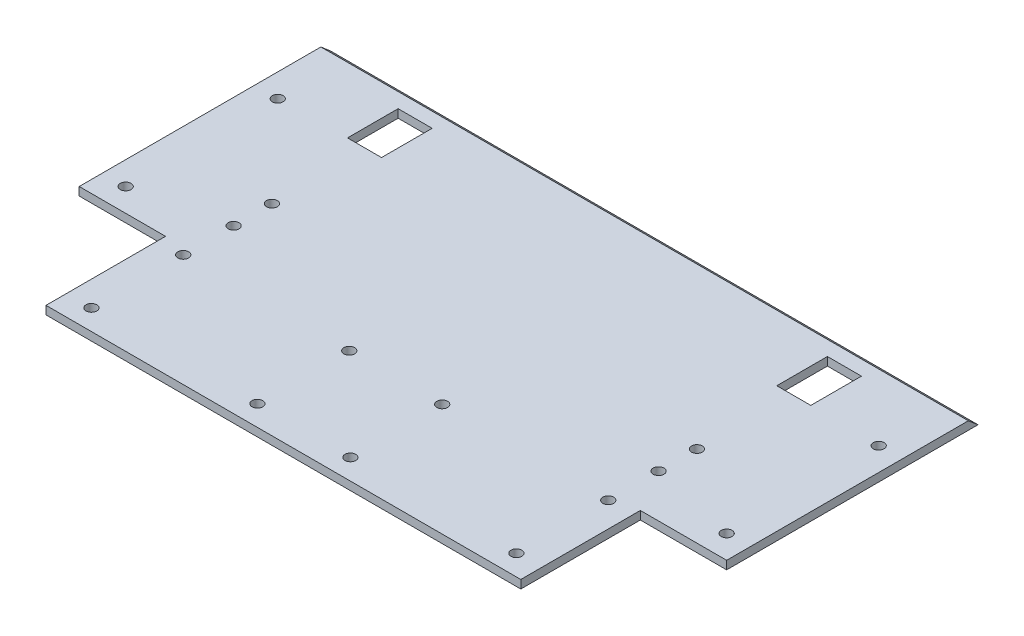
ISO-10303-21;
HEADER;
FILE_DESCRIPTION(('STEP AP214'),'2;1');
FILE_NAME('part.step','',(''),(''),'','','');
FILE_SCHEMA(('AUTOMOTIVE_DESIGN { 1 0 10303 214 1 1 1 1 }'));
ENDSEC;
DATA;
#1=APPLICATION_CONTEXT('core data for automotive mechanical design processes');
#2=APPLICATION_PROTOCOL_DEFINITION('international standard','automotive_design',2000,#1);
#3=PRODUCT_CONTEXT('',#1,'mechanical');
#4=PRODUCT('Part','Part','',(#3));
#5=PRODUCT_RELATED_PRODUCT_CATEGORY('part','',(#4));
#6=PRODUCT_DEFINITION_FORMATION('','',#4);
#7=PRODUCT_DEFINITION_CONTEXT('part definition',#1,'design');
#8=PRODUCT_DEFINITION('design','',#6,#7);
#9=PRODUCT_DEFINITION_SHAPE('','',#8);
#10=(LENGTH_UNIT() NAMED_UNIT(*) SI_UNIT(.MILLI.,.METRE.));
#11=(NAMED_UNIT(*) PLANE_ANGLE_UNIT() SI_UNIT($,.RADIAN.));
#12=(NAMED_UNIT(*) SI_UNIT($,.STERADIAN.) SOLID_ANGLE_UNIT());
#13=UNCERTAINTY_MEASURE_WITH_UNIT(LENGTH_MEASURE(1.E-05),#10,'distance_accuracy_value','');
#14=(GEOMETRIC_REPRESENTATION_CONTEXT(3) GLOBAL_UNCERTAINTY_ASSIGNED_CONTEXT((#13)) GLOBAL_UNIT_ASSIGNED_CONTEXT((#10,
#11,#12)) REPRESENTATION_CONTEXT('',''));
#15=CARTESIAN_POINT('',(0.,0.,0.));
#16=DIRECTION('',(0.,0.,1.));
#17=DIRECTION('',(1.,0.,0.));
#18=AXIS2_PLACEMENT_3D('',#15,#16,#17);
#19=CARTESIAN_POINT('',(-97.5,2.5,0.));
#20=DIRECTION('',(-1.,0.,0.));
#21=DIRECTION('',(0.,0.,1.));
#22=AXIS2_PLACEMENT_3D('',#19,#20,#21);
#23=PLANE('',#22);
#24=DIRECTION('',(0.,0.,-1.));
#25=VECTOR('',#24,1.);
#26=CARTESIAN_POINT('',(-97.5,0.,0.));
#27=LINE('',#26,#25);
#28=CARTESIAN_POINT('',(-97.5,0.,25.0000000000045));
#29=VERTEX_POINT('',#28);
#30=CARTESIAN_POINT('',(-97.5,0.,-50.6999999999954));
#31=VERTEX_POINT('',#30);
#32=EDGE_CURVE('E272',#29,#31,#27,.T.);
#33=ORIENTED_EDGE('',*,*,#32,.F.);
#34=DIRECTION('',(0.,-1.,0.));
#35=VECTOR('',#34,1.);
#36=CARTESIAN_POINT('',(-97.5,2.5,25.0000000000045));
#37=LINE('',#36,#35);
#38=CARTESIAN_POINT('',(-97.5,2.5,25.0000000000045));
#39=VERTEX_POINT('',#38);
#40=EDGE_CURVE('E11',#39,#29,#37,.T.);
#41=ORIENTED_EDGE('',*,*,#40,.F.);
#42=DIRECTION('',(0.,0.,-1.));
#43=VECTOR('',#42,1.);
#44=CARTESIAN_POINT('',(-97.5,2.5,0.));
#45=LINE('',#44,#43);
#46=CARTESIAN_POINT('',(-97.5,2.50000000000003,-47.7831999517202));
#47=VERTEX_POINT('',#46);
#48=EDGE_CURVE('E275',#39,#47,#45,.T.);
#49=ORIENTED_EDGE('',*,*,#48,.T.);
#50=DIRECTION('',(0.,0.650774217265846,0.759271307334885));
#51=VECTOR('',#50,1.);
#52=CARTESIAN_POINT('',(-97.5,2.50000000000001,-47.7831999517203));
#53=LINE('',#52,#51);
#54=EDGE_CURVE('E266',#31,#47,#53,.T.);
#55=ORIENTED_EDGE('',*,*,#54,.F.);
#56=EDGE_LOOP('',(#33,#41,#49,#55));
#57=FACE_BOUND('',#56,.T.);
#58=ADVANCED_FACE('F40',(#57),#23,.T.);
#59=CARTESIAN_POINT('',(0.,2.5,25.0000000000045));
#60=DIRECTION('',(0.,0.,1.));
#61=DIRECTION('',(1.,0.,0.));
#62=AXIS2_PLACEMENT_3D('',#59,#60,#61);
#63=PLANE('',#62);
#64=DIRECTION('',(-1.,0.,0.));
#65=VECTOR('',#64,1.);
#66=CARTESIAN_POINT('',(0.,0.,25.0000000000045));
#67=LINE('',#66,#65);
#68=CARTESIAN_POINT('',(-71.5,0.,25.0000000000045));
#69=VERTEX_POINT('',#68);
#70=EDGE_CURVE('E300',#69,#29,#67,.T.);
#71=ORIENTED_EDGE('',*,*,#70,.F.);
#72=DIRECTION('',(0.,-1.,0.));
#73=VECTOR('',#72,1.);
#74=CARTESIAN_POINT('',(-71.5,2.5,25.0000000000045));
#75=LINE('',#74,#73);
#76=CARTESIAN_POINT('',(-71.5,2.5,25.0000000000045));
#77=VERTEX_POINT('',#76);
#78=EDGE_CURVE('E48',#77,#69,#75,.T.);
#79=ORIENTED_EDGE('',*,*,#78,.F.);
#80=DIRECTION('',(-1.,0.,0.));
#81=VECTOR('',#80,1.);
#82=CARTESIAN_POINT('',(0.,2.5,25.0000000000045));
#83=LINE('',#82,#81);
#84=EDGE_CURVE('E277',#77,#39,#83,.T.);
#85=ORIENTED_EDGE('',*,*,#84,.T.);
#86=ORIENTED_EDGE('',*,*,#40,.T.);
#87=EDGE_LOOP('',(#71,#79,#85,#86));
#88=FACE_BOUND('',#87,.T.);
#89=ADVANCED_FACE('F425',(#88),#63,.T.);
#90=CARTESIAN_POINT('',(-71.5,2.5,0.));
#91=DIRECTION('',(-1.,0.,0.));
#92=DIRECTION('',(0.,0.,1.));
#93=AXIS2_PLACEMENT_3D('',#90,#91,#92);
#94=PLANE('',#93);
#95=DIRECTION('',(0.,0.,-1.));
#96=VECTOR('',#95,1.);
#97=CARTESIAN_POINT('',(-71.5,0.,0.));
#98=LINE('',#97,#96);
#99=CARTESIAN_POINT('',(-71.5,0.,61.0000000000045));
#100=VERTEX_POINT('',#99);
#101=EDGE_CURVE('E303',#100,#69,#98,.T.);
#102=ORIENTED_EDGE('',*,*,#101,.F.);
#103=DIRECTION('',(0.,-1.,0.));
#104=VECTOR('',#103,1.);
#105=CARTESIAN_POINT('',(-71.5,2.5,61.0000000000045));
#106=LINE('',#105,#104);
#107=CARTESIAN_POINT('',(-71.5,2.5,61.0000000000045));
#108=VERTEX_POINT('',#107);
#109=EDGE_CURVE('E327',#108,#100,#106,.T.);
#110=ORIENTED_EDGE('',*,*,#109,.F.);
#111=DIRECTION('',(0.,0.,-1.));
#112=VECTOR('',#111,1.);
#113=CARTESIAN_POINT('',(-71.5,2.5,0.));
#114=LINE('',#113,#112);
#115=EDGE_CURVE('E281',#108,#77,#114,.T.);
#116=ORIENTED_EDGE('',*,*,#115,.T.);
#117=ORIENTED_EDGE('',*,*,#78,.T.);
#118=EDGE_LOOP('',(#102,#110,#116,#117));
#119=FACE_BOUND('',#118,.T.);
#120=ADVANCED_FACE('F430',(#119),#94,.T.);
#121=CARTESIAN_POINT('',(0.,2.5,61.0000000000045));
#122=DIRECTION('',(0.,0.,-1.));
#123=DIRECTION('',(-1.,0.,0.));
#124=AXIS2_PLACEMENT_3D('',#121,#122,#123);
#125=PLANE('',#124);
#126=DIRECTION('',(1.,0.,0.));
#127=VECTOR('',#126,1.);
#128=CARTESIAN_POINT('',(0.,0.,61.0000000000045));
#129=LINE('',#128,#127);
#130=CARTESIAN_POINT('',(71.5,0.,61.0000000000045));
#131=VERTEX_POINT('',#130);
#132=EDGE_CURVE('E306',#100,#131,#129,.T.);
#133=ORIENTED_EDGE('',*,*,#132,.T.);
#134=DIRECTION('',(0.,-1.,0.));
#135=VECTOR('',#134,1.);
#136=CARTESIAN_POINT('',(71.5,2.5,61.0000000000045));
#137=LINE('',#136,#135);
#138=CARTESIAN_POINT('',(71.5,2.5,61.0000000000045));
#139=VERTEX_POINT('',#138);
#140=EDGE_CURVE('E324',#139,#131,#137,.T.);
#141=ORIENTED_EDGE('',*,*,#140,.F.);
#142=DIRECTION('',(1.,0.,0.));
#143=VECTOR('',#142,1.);
#144=CARTESIAN_POINT('',(0.,2.5,61.0000000000045));
#145=LINE('',#144,#143);
#146=EDGE_CURVE('E284',#108,#139,#145,.T.);
#147=ORIENTED_EDGE('',*,*,#146,.F.);
#148=ORIENTED_EDGE('',*,*,#109,.T.);
#149=EDGE_LOOP('',(#133,#141,#147,#148));
#150=FACE_BOUND('',#149,.T.);
#151=ADVANCED_FACE('F446',(#150),#125,.F.);
#152=CARTESIAN_POINT('',(71.5,2.5,0.));
#153=DIRECTION('',(-1.,0.,0.));
#154=DIRECTION('',(0.,0.,1.));
#155=AXIS2_PLACEMENT_3D('',#152,#153,#154);
#156=PLANE('',#155);
#157=DIRECTION('',(0.,0.,-1.));
#158=VECTOR('',#157,1.);
#159=CARTESIAN_POINT('',(71.5,0.,0.));
#160=LINE('',#159,#158);
#161=CARTESIAN_POINT('',(71.5,0.,25.0000000000045));
#162=VERTEX_POINT('',#161);
#163=EDGE_CURVE('E308',#131,#162,#160,.T.);
#164=ORIENTED_EDGE('',*,*,#163,.T.);
#165=DIRECTION('',(0.,-1.,0.));
#166=VECTOR('',#165,1.);
#167=CARTESIAN_POINT('',(71.5,2.5,25.0000000000045));
#168=LINE('',#167,#166);
#169=CARTESIAN_POINT('',(71.5,2.5,25.0000000000045));
#170=VERTEX_POINT('',#169);
#171=EDGE_CURVE('E321',#170,#162,#168,.T.);
#172=ORIENTED_EDGE('',*,*,#171,.F.);
#173=DIRECTION('',(0.,0.,-1.));
#174=VECTOR('',#173,1.);
#175=CARTESIAN_POINT('',(71.5,2.5,0.));
#176=LINE('',#175,#174);
#177=EDGE_CURVE('E286',#139,#170,#176,.T.);
#178=ORIENTED_EDGE('',*,*,#177,.F.);
#179=ORIENTED_EDGE('',*,*,#140,.T.);
#180=EDGE_LOOP('',(#164,#172,#178,#179));
#181=FACE_BOUND('',#180,.T.);
#182=ADVANCED_FACE('F452',(#181),#156,.F.);
#183=CARTESIAN_POINT('',(0.,2.5,25.0000000000045));
#184=DIRECTION('',(0.,0.,-1.));
#185=DIRECTION('',(-1.,0.,0.));
#186=AXIS2_PLACEMENT_3D('',#183,#184,#185);
#187=PLANE('',#186);
#188=DIRECTION('',(1.,0.,0.));
#189=VECTOR('',#188,1.);
#190=CARTESIAN_POINT('',(0.,0.,25.0000000000045));
#191=LINE('',#190,#189);
#192=CARTESIAN_POINT('',(97.5,0.,25.0000000000045));
#193=VERTEX_POINT('',#192);
#194=EDGE_CURVE('E310',#162,#193,#191,.T.);
#195=ORIENTED_EDGE('',*,*,#194,.T.);
#196=DIRECTION('',(0.,-1.,0.));
#197=VECTOR('',#196,1.);
#198=CARTESIAN_POINT('',(97.5,2.5,25.0000000000045));
#199=LINE('',#198,#197);
#200=CARTESIAN_POINT('',(97.5,2.5,25.0000000000045));
#201=VERTEX_POINT('',#200);
#202=EDGE_CURVE('E298',#201,#193,#199,.T.);
#203=ORIENTED_EDGE('',*,*,#202,.F.);
#204=DIRECTION('',(1.,0.,0.));
#205=VECTOR('',#204,1.);
#206=CARTESIAN_POINT('',(0.,2.5,25.0000000000045));
#207=LINE('',#206,#205);
#208=EDGE_CURVE('E288',#170,#201,#207,.T.);
#209=ORIENTED_EDGE('',*,*,#208,.F.);
#210=ORIENTED_EDGE('',*,*,#171,.T.);
#211=EDGE_LOOP('',(#195,#203,#209,#210));
#212=FACE_BOUND('',#211,.T.);
#213=ADVANCED_FACE('F456',(#212),#187,.F.);
#214=CARTESIAN_POINT('',(90.5,2.5,18.0000000000045));
#215=DIRECTION('',(0.,-1.,0.));
#216=DIRECTION('',(0.,0.,-1.));
#217=AXIS2_PLACEMENT_3D('',#214,#215,#216);
#218=CYLINDRICAL_SURFACE('',#217,1.625);
#219=CARTESIAN_POINT('',(90.5,2.5,18.0000000000045));
#220=DIRECTION('',(0.,1.,0.));
#221=DIRECTION('',(0.,0.,1.));
#222=AXIS2_PLACEMENT_3D('',#219,#220,#221);
#223=CIRCLE('',#222,1.625);
#224=CARTESIAN_POINT('',(90.5,2.5,19.6250000000045));
#225=VERTEX_POINT('',#224);
#226=EDGE_CURVE('E292',#225,#225,#223,.T.);
#227=ORIENTED_EDGE('',*,*,#226,.T.);
#228=EDGE_LOOP('',(#227));
#229=FACE_BOUND('',#228,.T.);
#230=CARTESIAN_POINT('',(90.5,0.,18.0000000000045));
#231=DIRECTION('',(0.,1.,0.));
#232=DIRECTION('',(0.,0.,1.));
#233=AXIS2_PLACEMENT_3D('',#230,#231,#232);
#234=CIRCLE('',#233,1.625);
#235=CARTESIAN_POINT('',(90.5,0.,19.6250000000045));
#236=VERTEX_POINT('',#235);
#237=EDGE_CURVE('E314',#236,#236,#234,.T.);
#238=ORIENTED_EDGE('',*,*,#237,.F.);
#239=EDGE_LOOP('',(#238));
#240=FACE_BOUND('',#239,.T.);
#241=ADVANCED_FACE('F419',(#229,#240),#218,.F.);
#242=CARTESIAN_POINT('',(97.5,2.5,0.));
#243=DIRECTION('',(-1.,0.,0.));
#244=DIRECTION('',(0.,0.,1.));
#245=AXIS2_PLACEMENT_3D('',#242,#243,#244);
#246=PLANE('',#245);
#247=DIRECTION('',(0.,0.,-1.));
#248=VECTOR('',#247,1.);
#249=CARTESIAN_POINT('',(97.5,0.,0.));
#250=LINE('',#249,#248);
#251=CARTESIAN_POINT('',(97.5,0.,-50.6999999999955));
#252=VERTEX_POINT('',#251);
#253=EDGE_CURVE('E312',#193,#252,#250,.T.);
#254=ORIENTED_EDGE('',*,*,#253,.T.);
#255=DIRECTION('',(0.,0.650774217265846,0.759271307334885));
#256=VECTOR('',#255,1.);
#257=CARTESIAN_POINT('',(97.5,2.5,-47.7831999517204));
#258=LINE('',#257,#256);
#259=CARTESIAN_POINT('',(97.5,2.5,-47.7831999517204));
#260=VERTEX_POINT('',#259);
#261=EDGE_CURVE('E261',#252,#260,#258,.T.);
#262=ORIENTED_EDGE('',*,*,#261,.T.);
#263=DIRECTION('',(0.,0.,-1.));
#264=VECTOR('',#263,1.);
#265=CARTESIAN_POINT('',(97.5,2.5,0.));
#266=LINE('',#265,#264);
#267=EDGE_CURVE('E290',#201,#260,#266,.T.);
#268=ORIENTED_EDGE('',*,*,#267,.F.);
#269=ORIENTED_EDGE('',*,*,#202,.T.);
#270=EDGE_LOOP('',(#254,#262,#268,#269));
#271=FACE_BOUND('',#270,.T.);
#272=ADVANCED_FACE('F410',(#271),#246,.F.);
#273=CARTESIAN_POINT('',(-90.5,2.5,18.0000000000045));
#274=DIRECTION('',(0.,-1.,0.));
#275=DIRECTION('',(0.,0.,-1.));
#276=AXIS2_PLACEMENT_3D('',#273,#274,#275);
#277=CYLINDRICAL_SURFACE('',#276,1.625);
#278=CARTESIAN_POINT('',(-90.5,2.5,18.0000000000045));
#279=DIRECTION('',(0.,1.,0.));
#280=DIRECTION('',(0.,0.,1.));
#281=AXIS2_PLACEMENT_3D('',#278,#279,#280);
#282=CIRCLE('',#281,1.625);
#283=CARTESIAN_POINT('',(-90.5,2.5,19.6250000000045));
#284=VERTEX_POINT('',#283);
#285=EDGE_CURVE('E295',#284,#284,#282,.F.);
#286=ORIENTED_EDGE('',*,*,#285,.F.);
#287=EDGE_LOOP('',(#286));
#288=FACE_BOUND('',#287,.T.);
#289=CARTESIAN_POINT('',(-90.5,0.,18.0000000000045));
#290=DIRECTION('',(0.,1.,0.));
#291=DIRECTION('',(0.,0.,1.));
#292=AXIS2_PLACEMENT_3D('',#289,#290,#291);
#293=CIRCLE('',#292,1.625);
#294=CARTESIAN_POINT('',(-90.5,0.,19.6250000000045));
#295=VERTEX_POINT('',#294);
#296=EDGE_CURVE('E278',#295,#295,#293,.F.);
#297=ORIENTED_EDGE('',*,*,#296,.T.);
#298=EDGE_LOOP('',(#297));
#299=FACE_BOUND('',#298,.T.);
#300=ADVANCED_FACE('F408',(#288,#299),#277,.F.);
#301=CARTESIAN_POINT('',(0.,2.5,0.));
#302=DIRECTION('',(0.,1.,0.));
#303=DIRECTION('',(0.,0.,1.));
#304=AXIS2_PLACEMENT_3D('',#301,#302,#303);
#305=PLANE('',#304);
#306=DIRECTION('',(0.,0.,-1.));
#307=VECTOR('',#306,1.);
#308=CARTESIAN_POINT('',(-59.5180736102201,2.5,0.));
#309=LINE('',#308,#307);
#310=CARTESIAN_POINT('',(-59.5180736102202,2.5,-28.0749999999954));
#311=VERTEX_POINT('',#310);
#312=CARTESIAN_POINT('',(-59.5180736102202,2.5,-43.3249999999954));
#313=VERTEX_POINT('',#312);
#314=EDGE_CURVE('E215',#311,#313,#309,.T.);
#315=ORIENTED_EDGE('',*,*,#314,.F.);
#316=DIRECTION('',(1.,0.,0.));
#317=VECTOR('',#316,1.);
#318=CARTESIAN_POINT('',(0.,2.5,-28.0749999999954));
#319=LINE('',#318,#317);
#320=CARTESIAN_POINT('',(-69.7680736102202,2.5,-28.0749999999954));
#321=VERTEX_POINT('',#320);
#322=EDGE_CURVE('E210',#321,#311,#319,.T.);
#323=ORIENTED_EDGE('',*,*,#322,.F.);
#324=DIRECTION('',(0.,0.,1.));
#325=VECTOR('',#324,1.);
#326=CARTESIAN_POINT('',(-69.7680736102202,2.5,0.));
#327=LINE('',#326,#325);
#328=CARTESIAN_POINT('',(-69.7680736102202,2.5,-43.3249999999954));
#329=VERTEX_POINT('',#328);
#330=EDGE_CURVE('E158',#329,#321,#327,.T.);
#331=ORIENTED_EDGE('',*,*,#330,.F.);
#332=DIRECTION('',(-1.,0.,0.));
#333=VECTOR('',#332,1.);
#334=CARTESIAN_POINT('',(0.,2.5,-43.3249999999954));
#335=LINE('',#334,#333);
#336=EDGE_CURVE('E213',#313,#329,#335,.T.);
#337=ORIENTED_EDGE('',*,*,#336,.F.);
#338=EDGE_LOOP('',(#315,#323,#331,#337));
#339=FACE_BOUND('',#338,.T.);
#340=DIRECTION('',(0.,0.,-1.));
#341=VECTOR('',#340,1.);
#342=CARTESIAN_POINT('',(69.7680736102202,2.5,0.));
#343=LINE('',#342,#341);
#344=CARTESIAN_POINT('',(69.7680736102202,2.5,-28.0749999999954));
#345=VERTEX_POINT('',#344);
#346=CARTESIAN_POINT('',(69.7680736102202,2.5,-43.3249999999954));
#347=VERTEX_POINT('',#346);
#348=EDGE_CURVE('E208',#345,#347,#343,.T.);
#349=ORIENTED_EDGE('',*,*,#348,.F.);
#350=DIRECTION('',(1.,0.,0.));
#351=VECTOR('',#350,1.);
#352=CARTESIAN_POINT('',(0.,2.5,-28.0749999999954));
#353=LINE('',#352,#351);
#354=CARTESIAN_POINT('',(59.5180736102202,2.5,-28.0749999999954));
#355=VERTEX_POINT('',#354);
#356=EDGE_CURVE('E182',#355,#345,#353,.T.);
#357=ORIENTED_EDGE('',*,*,#356,.F.);
#358=DIRECTION('',(0.,0.,1.));
#359=VECTOR('',#358,1.);
#360=CARTESIAN_POINT('',(59.5180736102201,2.5,0.));
#361=LINE('',#360,#359);
#362=CARTESIAN_POINT('',(59.5180736102202,2.5,-43.3249999999954));
#363=VERTEX_POINT('',#362);
#364=EDGE_CURVE('E204',#363,#355,#361,.T.);
#365=ORIENTED_EDGE('',*,*,#364,.F.);
#366=DIRECTION('',(-1.,0.,0.));
#367=VECTOR('',#366,1.);
#368=CARTESIAN_POINT('',(0.,2.5,-43.3249999999954));
#369=LINE('',#368,#367);
#370=EDGE_CURVE('E206',#347,#363,#369,.T.);
#371=ORIENTED_EDGE('',*,*,#370,.F.);
#372=EDGE_LOOP('',(#349,#357,#365,#371));
#373=FACE_BOUND('',#372,.T.);
#374=CARTESIAN_POINT('',(14.,2.5,27.1754000000041));
#375=DIRECTION('',(0.,-1.,0.));
#376=DIRECTION('',(0.,0.,-1.));
#377=AXIS2_PLACEMENT_3D('',#374,#375,#376);
#378=CIRCLE('',#377,1.625);
#379=CARTESIAN_POINT('',(14.,2.5,25.5504000000041));
#380=VERTEX_POINT('',#379);
#381=EDGE_CURVE('E221',#380,#380,#378,.T.);
#382=ORIENTED_EDGE('',*,*,#381,.T.);
#383=EDGE_LOOP('',(#382));
#384=FACE_BOUND('',#383,.T.);
#385=CARTESIAN_POINT('',(-64.,2.5,27.1754000000044));
#386=DIRECTION('',(0.,-1.,0.));
#387=DIRECTION('',(0.,0.,1.));
#388=AXIS2_PLACEMENT_3D('',#385,#386,#387);
#389=CIRCLE('',#388,1.625);
#390=CARTESIAN_POINT('',(-64.,2.5,28.8004000000044));
#391=VERTEX_POINT('',#390);
#392=EDGE_CURVE('E234',#391,#391,#389,.T.);
#393=ORIENTED_EDGE('',*,*,#392,.T.);
#394=EDGE_LOOP('',(#393));
#395=FACE_BOUND('',#394,.T.);
#396=CARTESIAN_POINT('',(-64.,2.5,54.8245000000044));
#397=DIRECTION('',(0.,-1.,0.));
#398=DIRECTION('',(0.,0.,1.));
#399=AXIS2_PLACEMENT_3D('',#396,#397,#398);
#400=CIRCLE('',#399,1.625);
#401=CARTESIAN_POINT('',(-64.,2.5,56.4495000000044));
#402=VERTEX_POINT('',#401);
#403=EDGE_CURVE('E231',#402,#402,#400,.T.);
#404=ORIENTED_EDGE('',*,*,#403,.T.);
#405=EDGE_LOOP('',(#404));
#406=FACE_BOUND('',#405,.T.);
#407=CARTESIAN_POINT('',(64.,2.5,54.8245000000045));
#408=DIRECTION('',(0.,-1.,0.));
#409=DIRECTION('',(0.,0.,-1.));
#410=AXIS2_PLACEMENT_3D('',#407,#408,#409);
#411=CIRCLE('',#410,1.625);
#412=CARTESIAN_POINT('',(64.,2.5,53.1995000000045));
#413=VERTEX_POINT('',#412);
#414=EDGE_CURVE('E227',#413,#413,#411,.T.);
#415=ORIENTED_EDGE('',*,*,#414,.T.);
#416=EDGE_LOOP('',(#415));
#417=FACE_BOUND('',#416,.T.);
#418=CARTESIAN_POINT('',(-64.,2.5,12.0000000000045));
#419=DIRECTION('',(0.,-1.,0.));
#420=DIRECTION('',(0.,0.,1.));
#421=AXIS2_PLACEMENT_3D('',#418,#419,#420);
#422=CIRCLE('',#421,1.625);
#423=CARTESIAN_POINT('',(-64.,2.5,13.6250000000045));
#424=VERTEX_POINT('',#423);
#425=EDGE_CURVE('E230',#424,#424,#422,.T.);
#426=ORIENTED_EDGE('',*,*,#425,.T.);
#427=EDGE_LOOP('',(#426));
#428=FACE_BOUND('',#427,.T.);
#429=CARTESIAN_POINT('',(-64.,2.5,0.460000000004494));
#430=DIRECTION('',(0.,-1.,0.));
#431=DIRECTION('',(0.,0.,1.));
#432=AXIS2_PLACEMENT_3D('',#429,#430,#431);
#433=CIRCLE('',#432,1.625);
#434=CARTESIAN_POINT('',(-64.,2.5,2.0850000000045));
#435=VERTEX_POINT('',#434);
#436=EDGE_CURVE('E246',#435,#435,#433,.T.);
#437=ORIENTED_EDGE('',*,*,#436,.T.);
#438=EDGE_LOOP('',(#437));
#439=FACE_BOUND('',#438,.T.);
#440=CARTESIAN_POINT('',(64.,2.5,27.1754000000045));
#441=DIRECTION('',(0.,-1.,0.));
#442=DIRECTION('',(0.,0.,-1.));
#443=AXIS2_PLACEMENT_3D('',#440,#441,#442);
#444=CIRCLE('',#443,1.625);
#445=CARTESIAN_POINT('',(64.,2.5,25.5504000000045));
#446=VERTEX_POINT('',#445);
#447=EDGE_CURVE('E243',#446,#446,#444,.T.);
#448=ORIENTED_EDGE('',*,*,#447,.T.);
#449=EDGE_LOOP('',(#448));
#450=FACE_BOUND('',#449,.T.);
#451=CARTESIAN_POINT('',(64.,2.5,12.0000000000045));
#452=DIRECTION('',(0.,-1.,0.));
#453=DIRECTION('',(0.,0.,-1.));
#454=AXIS2_PLACEMENT_3D('',#451,#452,#453);
#455=CIRCLE('',#454,1.625);
#456=CARTESIAN_POINT('',(64.,2.5,10.3750000000045));
#457=VERTEX_POINT('',#456);
#458=EDGE_CURVE('E239',#457,#457,#455,.T.);
#459=ORIENTED_EDGE('',*,*,#458,.T.);
#460=EDGE_LOOP('',(#459));
#461=FACE_BOUND('',#460,.T.);
#462=CARTESIAN_POINT('',(14.,2.5,54.8245000000042));
#463=DIRECTION('',(0.,-1.,0.));
#464=DIRECTION('',(0.,0.,-1.));
#465=AXIS2_PLACEMENT_3D('',#462,#463,#464);
#466=CIRCLE('',#465,1.625);
#467=CARTESIAN_POINT('',(14.,2.5,53.1995000000041));
#468=VERTEX_POINT('',#467);
#469=EDGE_CURVE('E218',#468,#468,#466,.T.);
#470=ORIENTED_EDGE('',*,*,#469,.T.);
#471=EDGE_LOOP('',(#470));
#472=FACE_BOUND('',#471,.T.);
#473=CARTESIAN_POINT('',(-14.,2.5,54.8245000000041));
#474=DIRECTION('',(0.,-1.,0.));
#475=DIRECTION('',(0.,0.,1.));
#476=AXIS2_PLACEMENT_3D('',#473,#474,#475);
#477=CIRCLE('',#476,1.625);
#478=CARTESIAN_POINT('',(-14.,2.5,56.4495000000041));
#479=VERTEX_POINT('',#478);
#480=EDGE_CURVE('E222',#479,#479,#477,.T.);
#481=ORIENTED_EDGE('',*,*,#480,.T.);
#482=EDGE_LOOP('',(#481));
#483=FACE_BOUND('',#482,.T.);
#484=CARTESIAN_POINT('',(-14.,2.5,27.1754000000041));
#485=DIRECTION('',(0.,-1.,0.));
#486=DIRECTION('',(0.,0.,1.));
#487=AXIS2_PLACEMENT_3D('',#484,#485,#486);
#488=CIRCLE('',#487,1.625);
#489=CARTESIAN_POINT('',(-14.,2.5,28.8004000000041));
#490=VERTEX_POINT('',#489);
#491=EDGE_CURVE('E217',#490,#490,#488,.T.);
#492=ORIENTED_EDGE('',*,*,#491,.T.);
#493=EDGE_LOOP('',(#492));
#494=FACE_BOUND('',#493,.T.);
#495=CARTESIAN_POINT('',(64.,2.5,0.460000000004494));
#496=DIRECTION('',(0.,-1.,0.));
#497=DIRECTION('',(0.,0.,-1.));
#498=AXIS2_PLACEMENT_3D('',#495,#496,#497);
#499=CIRCLE('',#498,1.625);
#500=CARTESIAN_POINT('',(64.,2.5,-1.16499999999551));
#501=VERTEX_POINT('',#500);
#502=EDGE_CURVE('E242',#501,#501,#499,.T.);
#503=ORIENTED_EDGE('',*,*,#502,.T.);
#504=EDGE_LOOP('',(#503));
#505=FACE_BOUND('',#504,.T.);
#506=CARTESIAN_POINT('',(90.5000000000001,2.5,-27.7831999517202));
#507=DIRECTION('',(0.,1.,0.));
#508=DIRECTION('',(0.,0.,1.));
#509=AXIS2_PLACEMENT_3D('',#506,#507,#508);
#510=CIRCLE('',#509,1.625);
#511=CARTESIAN_POINT('',(90.5000000000001,2.5,-26.1581999517202));
#512=VERTEX_POINT('',#511);
#513=EDGE_CURVE('E254',#512,#512,#510,.T.);
#514=ORIENTED_EDGE('',*,*,#513,.F.);
#515=EDGE_LOOP('',(#514));
#516=FACE_BOUND('',#515,.T.);
#517=CARTESIAN_POINT('',(-90.5000000000001,2.5,-27.7831999517202));
#518=DIRECTION('',(0.,1.,0.));
#519=DIRECTION('',(0.,0.,-1.));
#520=AXIS2_PLACEMENT_3D('',#517,#518,#519);
#521=CIRCLE('',#520,1.625);
#522=CARTESIAN_POINT('',(-90.5000000000001,2.5,-29.4081999517202));
#523=VERTEX_POINT('',#522);
#524=EDGE_CURVE('E258',#523,#523,#521,.T.);
#525=ORIENTED_EDGE('',*,*,#524,.F.);
#526=EDGE_LOOP('',(#525));
#527=FACE_BOUND('',#526,.T.);
#528=ORIENTED_EDGE('',*,*,#267,.T.);
#529=DIRECTION('',(1.,0.,0.));
#530=VECTOR('',#529,1.);
#531=CARTESIAN_POINT('',(-142.5693909433,2.5,-47.7831999517202));
#532=LINE('',#531,#530);
#533=EDGE_CURVE('E269',#47,#260,#532,.T.);
#534=ORIENTED_EDGE('',*,*,#533,.F.);
#535=ORIENTED_EDGE('',*,*,#48,.F.);
#536=ORIENTED_EDGE('',*,*,#84,.F.);
#537=ORIENTED_EDGE('',*,*,#115,.F.);
#538=ORIENTED_EDGE('',*,*,#146,.T.);
#539=ORIENTED_EDGE('',*,*,#177,.T.);
#540=ORIENTED_EDGE('',*,*,#208,.T.);
#541=EDGE_LOOP('',(#528,#534,#535,#536,#537,#538,#539,#540));
#542=FACE_BOUND('',#541,.T.);
#543=ORIENTED_EDGE('',*,*,#226,.F.);
#544=EDGE_LOOP('',(#543));
#545=FACE_BOUND('',#544,.T.);
#546=ORIENTED_EDGE('',*,*,#285,.T.);
#547=EDGE_LOOP('',(#546));
#548=FACE_BOUND('',#547,.T.);
#549=ADVANCED_FACE('F374',(#339,#373,#384,#395,#406,#417,#428,#439,#450,#461,#472,#483,#494,
#505,#516,#527,#542,#545,#548),#305,.T.);
#550=CARTESIAN_POINT('',(0.,0.,0.));
#551=DIRECTION('',(0.,1.,0.));
#552=DIRECTION('',(0.,0.,1.));
#553=AXIS2_PLACEMENT_3D('',#550,#551,#552);
#554=PLANE('',#553);
#555=DIRECTION('',(-1.,0.,0.));
#556=VECTOR('',#555,1.);
#557=CARTESIAN_POINT('',(-69.7680736102202,0.,-28.0749999999954));
#558=LINE('',#557,#556);
#559=CARTESIAN_POINT('',(-59.5180736102202,0.,-28.0749999999954));
#560=VERTEX_POINT('',#559);
#561=CARTESIAN_POINT('',(-69.7680736102202,0.,-28.0749999999954));
#562=VERTEX_POINT('',#561);
#563=EDGE_CURVE('E165',#560,#562,#558,.T.);
#564=ORIENTED_EDGE('',*,*,#563,.F.);
#565=DIRECTION('',(0.,0.,1.));
#566=VECTOR('',#565,1.);
#567=CARTESIAN_POINT('',(-59.5180736102202,0.,-28.0749999999954));
#568=LINE('',#567,#566);
#569=CARTESIAN_POINT('',(-59.5180736102202,0.,-43.3249999999954));
#570=VERTEX_POINT('',#569);
#571=EDGE_CURVE('E170',#570,#560,#568,.T.);
#572=ORIENTED_EDGE('',*,*,#571,.F.);
#573=DIRECTION('',(1.,0.,0.));
#574=VECTOR('',#573,1.);
#575=CARTESIAN_POINT('',(-69.7680736102202,0.,-43.3249999999954));
#576=LINE('',#575,#574);
#577=CARTESIAN_POINT('',(-69.7680736102202,0.,-43.3249999999954));
#578=VERTEX_POINT('',#577);
#579=EDGE_CURVE('E175',#578,#570,#576,.T.);
#580=ORIENTED_EDGE('',*,*,#579,.F.);
#581=DIRECTION('',(0.,0.,-1.));
#582=VECTOR('',#581,1.);
#583=CARTESIAN_POINT('',(-69.7680736102202,0.,-28.0749999999954));
#584=LINE('',#583,#582);
#585=EDGE_CURVE('E155',#562,#578,#584,.T.);
#586=ORIENTED_EDGE('',*,*,#585,.F.);
#587=EDGE_LOOP('',(#564,#572,#580,#586));
#588=FACE_BOUND('',#587,.T.);
#589=DIRECTION('',(-1.,0.,0.));
#590=VECTOR('',#589,1.);
#591=CARTESIAN_POINT('',(69.7680736102202,0.,-28.0749999999954));
#592=LINE('',#591,#590);
#593=CARTESIAN_POINT('',(69.7680736102202,0.,-28.0749999999954));
#594=VERTEX_POINT('',#593);
#595=CARTESIAN_POINT('',(59.5180736102202,0.,-28.0749999999954));
#596=VERTEX_POINT('',#595);
#597=EDGE_CURVE('E187',#594,#596,#592,.T.);
#598=ORIENTED_EDGE('',*,*,#597,.F.);
#599=DIRECTION('',(0.,0.,1.));
#600=VECTOR('',#599,1.);
#601=CARTESIAN_POINT('',(69.7680736102202,0.,-28.0749999999954));
#602=LINE('',#601,#600);
#603=CARTESIAN_POINT('',(69.7680736102202,0.,-43.3249999999954));
#604=VERTEX_POINT('',#603);
#605=EDGE_CURVE('E185',#604,#594,#602,.T.);
#606=ORIENTED_EDGE('',*,*,#605,.F.);
#607=DIRECTION('',(1.,0.,0.));
#608=VECTOR('',#607,1.);
#609=CARTESIAN_POINT('',(69.7680736102202,0.,-43.3249999999954));
#610=LINE('',#609,#608);
#611=CARTESIAN_POINT('',(59.5180736102202,0.,-43.3249999999954));
#612=VERTEX_POINT('',#611);
#613=EDGE_CURVE('E192',#612,#604,#610,.T.);
#614=ORIENTED_EDGE('',*,*,#613,.F.);
#615=DIRECTION('',(0.,0.,-1.));
#616=VECTOR('',#615,1.);
#617=CARTESIAN_POINT('',(59.5180736102202,0.,-28.0749999999954));
#618=LINE('',#617,#616);
#619=EDGE_CURVE('E189',#596,#612,#618,.T.);
#620=ORIENTED_EDGE('',*,*,#619,.F.);
#621=EDGE_LOOP('',(#598,#606,#614,#620));
#622=FACE_BOUND('',#621,.T.);
#623=CARTESIAN_POINT('',(14.,0.,27.1754000000041));
#624=DIRECTION('',(0.,1.,0.));
#625=DIRECTION('',(0.,0.,1.));
#626=AXIS2_PLACEMENT_3D('',#623,#624,#625);
#627=CIRCLE('',#626,1.625);
#628=CARTESIAN_POINT('',(14.,0.,28.8004000000041));
#629=VERTEX_POINT('',#628);
#630=EDGE_CURVE('E43',#629,#629,#627,.F.);
#631=ORIENTED_EDGE('',*,*,#630,.F.);
#632=EDGE_LOOP('',(#631));
#633=FACE_BOUND('',#632,.T.);
#634=CARTESIAN_POINT('',(-64.,0.,27.1754000000044));
#635=DIRECTION('',(0.,1.,0.));
#636=DIRECTION('',(0.,0.,1.));
#637=AXIS2_PLACEMENT_3D('',#634,#635,#636);
#638=CIRCLE('',#637,1.625);
#639=CARTESIAN_POINT('',(-64.,0.,28.8004000000044));
#640=VERTEX_POINT('',#639);
#641=EDGE_CURVE('E362',#640,#640,#638,.F.);
#642=ORIENTED_EDGE('',*,*,#641,.F.);
#643=EDGE_LOOP('',(#642));
#644=FACE_BOUND('',#643,.T.);
#645=CARTESIAN_POINT('',(-64.,0.,54.8245000000044));
#646=DIRECTION('',(0.,1.,0.));
#647=DIRECTION('',(0.,0.,1.));
#648=AXIS2_PLACEMENT_3D('',#645,#646,#647);
#649=CIRCLE('',#648,1.625);
#650=CARTESIAN_POINT('',(-64.,0.,56.4495000000044));
#651=VERTEX_POINT('',#650);
#652=EDGE_CURVE('E360',#651,#651,#649,.F.);
#653=ORIENTED_EDGE('',*,*,#652,.F.);
#654=EDGE_LOOP('',(#653));
#655=FACE_BOUND('',#654,.T.);
#656=CARTESIAN_POINT('',(64.,0.,54.8245000000045));
#657=DIRECTION('',(0.,1.,0.));
#658=DIRECTION('',(0.,0.,1.));
#659=AXIS2_PLACEMENT_3D('',#656,#657,#658);
#660=CIRCLE('',#659,1.625);
#661=CARTESIAN_POINT('',(64.,0.,56.4495000000045));
#662=VERTEX_POINT('',#661);
#663=EDGE_CURVE('E357',#662,#662,#660,.F.);
#664=ORIENTED_EDGE('',*,*,#663,.F.);
#665=EDGE_LOOP('',(#664));
#666=FACE_BOUND('',#665,.T.);
#667=CARTESIAN_POINT('',(-64.,0.,12.0000000000045));
#668=DIRECTION('',(0.,1.,0.));
#669=DIRECTION('',(0.,0.,1.));
#670=AXIS2_PLACEMENT_3D('',#667,#668,#669);
#671=CIRCLE('',#670,1.625);
#672=CARTESIAN_POINT('',(-64.,0.,13.6250000000045));
#673=VERTEX_POINT('',#672);
#674=EDGE_CURVE('E354',#673,#673,#671,.F.);
#675=ORIENTED_EDGE('',*,*,#674,.F.);
#676=EDGE_LOOP('',(#675));
#677=FACE_BOUND('',#676,.T.);
#678=CARTESIAN_POINT('',(-64.,0.,0.460000000004494));
#679=DIRECTION('',(0.,1.,0.));
#680=DIRECTION('',(0.,0.,1.));
#681=AXIS2_PLACEMENT_3D('',#678,#679,#680);
#682=CIRCLE('',#681,1.625);
#683=CARTESIAN_POINT('',(-64.,0.,2.0850000000045));
#684=VERTEX_POINT('',#683);
#685=EDGE_CURVE('E351',#684,#684,#682,.F.);
#686=ORIENTED_EDGE('',*,*,#685,.F.);
#687=EDGE_LOOP('',(#686));
#688=FACE_BOUND('',#687,.T.);
#689=CARTESIAN_POINT('',(64.,0.,27.1754000000045));
#690=DIRECTION('',(0.,1.,0.));
#691=DIRECTION('',(0.,0.,1.));
#692=AXIS2_PLACEMENT_3D('',#689,#690,#691);
#693=CIRCLE('',#692,1.625);
#694=CARTESIAN_POINT('',(64.,0.,28.8004000000045));
#695=VERTEX_POINT('',#694);
#696=EDGE_CURVE('E348',#695,#695,#693,.F.);
#697=ORIENTED_EDGE('',*,*,#696,.F.);
#698=EDGE_LOOP('',(#697));
#699=FACE_BOUND('',#698,.T.);
#700=CARTESIAN_POINT('',(64.,0.,12.0000000000045));
#701=DIRECTION('',(0.,1.,0.));
#702=DIRECTION('',(0.,0.,1.));
#703=AXIS2_PLACEMENT_3D('',#700,#701,#702);
#704=CIRCLE('',#703,1.625);
#705=CARTESIAN_POINT('',(64.,0.,13.6250000000045));
#706=VERTEX_POINT('',#705);
#707=EDGE_CURVE('E345',#706,#706,#704,.F.);
#708=ORIENTED_EDGE('',*,*,#707,.F.);
#709=EDGE_LOOP('',(#708));
#710=FACE_BOUND('',#709,.T.);
#711=CARTESIAN_POINT('',(14.,0.,54.8245000000042));
#712=DIRECTION('',(0.,1.,0.));
#713=DIRECTION('',(0.,0.,1.));
#714=AXIS2_PLACEMENT_3D('',#711,#712,#713);
#715=CIRCLE('',#714,1.625);
#716=CARTESIAN_POINT('',(14.,0.,56.4495000000042));
#717=VERTEX_POINT('',#716);
#718=EDGE_CURVE('E342',#717,#717,#715,.F.);
#719=ORIENTED_EDGE('',*,*,#718,.F.);
#720=EDGE_LOOP('',(#719));
#721=FACE_BOUND('',#720,.T.);
#722=CARTESIAN_POINT('',(-14.,0.,54.8245000000041));
#723=DIRECTION('',(0.,1.,0.));
#724=DIRECTION('',(0.,0.,1.));
#725=AXIS2_PLACEMENT_3D('',#722,#723,#724);
#726=CIRCLE('',#725,1.625);
#727=CARTESIAN_POINT('',(-14.,0.,56.4495000000041));
#728=VERTEX_POINT('',#727);
#729=EDGE_CURVE('E339',#728,#728,#726,.F.);
#730=ORIENTED_EDGE('',*,*,#729,.F.);
#731=EDGE_LOOP('',(#730));
#732=FACE_BOUND('',#731,.T.);
#733=CARTESIAN_POINT('',(-14.,0.,27.1754000000041));
#734=DIRECTION('',(0.,1.,0.));
#735=DIRECTION('',(0.,0.,1.));
#736=AXIS2_PLACEMENT_3D('',#733,#734,#735);
#737=CIRCLE('',#736,1.625);
#738=CARTESIAN_POINT('',(-14.,0.,28.8004000000041));
#739=VERTEX_POINT('',#738);
#740=EDGE_CURVE('E336',#739,#739,#737,.F.);
#741=ORIENTED_EDGE('',*,*,#740,.F.);
#742=EDGE_LOOP('',(#741));
#743=FACE_BOUND('',#742,.T.);
#744=CARTESIAN_POINT('',(64.,0.,0.460000000004494));
#745=DIRECTION('',(0.,1.,0.));
#746=DIRECTION('',(0.,0.,1.));
#747=AXIS2_PLACEMENT_3D('',#744,#745,#746);
#748=CIRCLE('',#747,1.625);
#749=CARTESIAN_POINT('',(64.,0.,2.0850000000045));
#750=VERTEX_POINT('',#749);
#751=EDGE_CURVE('E253',#750,#750,#748,.F.);
#752=ORIENTED_EDGE('',*,*,#751,.F.);
#753=EDGE_LOOP('',(#752));
#754=FACE_BOUND('',#753,.T.);
#755=CARTESIAN_POINT('',(90.5000000000001,0.,-27.7831999517202));
#756=DIRECTION('',(0.,1.,0.));
#757=DIRECTION('',(0.,0.,1.));
#758=AXIS2_PLACEMENT_3D('',#755,#756,#757);
#759=CIRCLE('',#758,1.625);
#760=CARTESIAN_POINT('',(90.5000000000001,0.,-26.1581999517202));
#761=VERTEX_POINT('',#760);
#762=EDGE_CURVE('E265',#761,#761,#759,.T.);
#763=ORIENTED_EDGE('',*,*,#762,.T.);
#764=EDGE_LOOP('',(#763));
#765=FACE_BOUND('',#764,.T.);
#766=CARTESIAN_POINT('',(-90.5000000000001,0.,-27.7831999517202));
#767=DIRECTION('',(0.,1.,0.));
#768=DIRECTION('',(0.,0.,1.));
#769=AXIS2_PLACEMENT_3D('',#766,#767,#768);
#770=CIRCLE('',#769,1.625);
#771=CARTESIAN_POINT('',(-90.5000000000001,0.,-26.1581999517202));
#772=VERTEX_POINT('',#771);
#773=EDGE_CURVE('E257',#772,#772,#770,.T.);
#774=ORIENTED_EDGE('',*,*,#773,.T.);
#775=EDGE_LOOP('',(#774));
#776=FACE_BOUND('',#775,.T.);
#777=ORIENTED_EDGE('',*,*,#32,.T.);
#778=DIRECTION('',(1.,0.,0.));
#779=VECTOR('',#778,1.);
#780=CARTESIAN_POINT('',(-142.5693909433,0.,-50.6999999999953));
#781=LINE('',#780,#779);
#782=EDGE_CURVE('E264',#31,#252,#781,.T.);
#783=ORIENTED_EDGE('',*,*,#782,.T.);
#784=ORIENTED_EDGE('',*,*,#253,.F.);
#785=ORIENTED_EDGE('',*,*,#194,.F.);
#786=ORIENTED_EDGE('',*,*,#163,.F.);
#787=ORIENTED_EDGE('',*,*,#132,.F.);
#788=ORIENTED_EDGE('',*,*,#101,.T.);
#789=ORIENTED_EDGE('',*,*,#70,.T.);
#790=EDGE_LOOP('',(#777,#783,#784,#785,#786,#787,#788,#789));
#791=FACE_BOUND('',#790,.T.);
#792=ORIENTED_EDGE('',*,*,#237,.T.);
#793=EDGE_LOOP('',(#792));
#794=FACE_BOUND('',#793,.T.);
#795=ORIENTED_EDGE('',*,*,#296,.F.);
#796=EDGE_LOOP('',(#795));
#797=FACE_BOUND('',#796,.T.);
#798=ADVANCED_FACE('F172',(#588,#622,#633,#644,#655,#666,#677,#688,#699,#710,#721,#732,#743,
#754,#765,#776,#791,#794,#797),#554,.F.);
#799=CARTESIAN_POINT('',(-142.5693909433,2.5,-47.7831999517202));
#800=DIRECTION('',(0.,0.759271307334885,-0.650774217265846));
#801=DIRECTION('',(0.,0.650774217265846,0.759271307334885));
#802=AXIS2_PLACEMENT_3D('',#799,#800,#801);
#803=PLANE('',#802);
#804=ORIENTED_EDGE('',*,*,#782,.F.);
#805=ORIENTED_EDGE('',*,*,#54,.T.);
#806=ORIENTED_EDGE('',*,*,#533,.T.);
#807=ORIENTED_EDGE('',*,*,#261,.F.);
#808=EDGE_LOOP('',(#804,#805,#806,#807));
#809=FACE_BOUND('',#808,.T.);
#810=ADVANCED_FACE('F373',(#809),#803,.T.);
#811=CARTESIAN_POINT('',(-90.5000000000001,-7.5,-27.7831999517202));
#812=DIRECTION('',(0.,1.,0.));
#813=DIRECTION('',(0.,0.,1.));
#814=AXIS2_PLACEMENT_3D('',#811,#812,#813);
#815=CYLINDRICAL_SURFACE('',#814,1.625);
#816=ORIENTED_EDGE('',*,*,#524,.T.);
#817=EDGE_LOOP('',(#816));
#818=FACE_BOUND('',#817,.T.);
#819=ORIENTED_EDGE('',*,*,#773,.F.);
#820=EDGE_LOOP('',(#819));
#821=FACE_BOUND('',#820,.T.);
#822=ADVANCED_FACE('F462',(#818,#821),#815,.F.);
#823=CARTESIAN_POINT('',(90.5000000000001,-7.5,-27.7831999517202));
#824=DIRECTION('',(0.,1.,0.));
#825=DIRECTION('',(0.,0.,1.));
#826=AXIS2_PLACEMENT_3D('',#823,#824,#825);
#827=CYLINDRICAL_SURFACE('',#826,1.625);
#828=ORIENTED_EDGE('',*,*,#513,.T.);
#829=EDGE_LOOP('',(#828));
#830=FACE_BOUND('',#829,.T.);
#831=ORIENTED_EDGE('',*,*,#762,.F.);
#832=EDGE_LOOP('',(#831));
#833=FACE_BOUND('',#832,.T.);
#834=ADVANCED_FACE('F467',(#830,#833),#827,.F.);
#835=CARTESIAN_POINT('',(64.,-7.5,0.460000000004494));
#836=DIRECTION('',(0.,1.,0.));
#837=DIRECTION('',(0.,0.,1.));
#838=AXIS2_PLACEMENT_3D('',#835,#836,#837);
#839=CYLINDRICAL_SURFACE('',#838,1.625);
#840=ORIENTED_EDGE('',*,*,#502,.F.);
#841=EDGE_LOOP('',(#840));
#842=FACE_BOUND('',#841,.T.);
#843=ORIENTED_EDGE('',*,*,#751,.T.);
#844=EDGE_LOOP('',(#843));
#845=FACE_BOUND('',#844,.T.);
#846=ADVANCED_FACE('F473',(#842,#845),#839,.F.);
#847=CARTESIAN_POINT('',(-14.,-7.5,27.1754000000041));
#848=DIRECTION('',(0.,1.,0.));
#849=DIRECTION('',(0.,0.,1.));
#850=AXIS2_PLACEMENT_3D('',#847,#848,#849);
#851=CYLINDRICAL_SURFACE('',#850,1.625);
#852=ORIENTED_EDGE('',*,*,#491,.F.);
#853=EDGE_LOOP('',(#852));
#854=FACE_BOUND('',#853,.T.);
#855=ORIENTED_EDGE('',*,*,#740,.T.);
#856=EDGE_LOOP('',(#855));
#857=FACE_BOUND('',#856,.T.);
#858=ADVANCED_FACE('F477',(#854,#857),#851,.F.);
#859=CARTESIAN_POINT('',(-14.,-7.5,54.8245000000041));
#860=DIRECTION('',(0.,1.,0.));
#861=DIRECTION('',(0.,0.,1.));
#862=AXIS2_PLACEMENT_3D('',#859,#860,#861);
#863=CYLINDRICAL_SURFACE('',#862,1.625);
#864=ORIENTED_EDGE('',*,*,#480,.F.);
#865=EDGE_LOOP('',(#864));
#866=FACE_BOUND('',#865,.T.);
#867=ORIENTED_EDGE('',*,*,#729,.T.);
#868=EDGE_LOOP('',(#867));
#869=FACE_BOUND('',#868,.T.);
#870=ADVANCED_FACE('F514',(#866,#869),#863,.F.);
#871=CARTESIAN_POINT('',(14.,-7.5,54.8245000000042));
#872=DIRECTION('',(0.,1.,0.));
#873=DIRECTION('',(0.,0.,1.));
#874=AXIS2_PLACEMENT_3D('',#871,#872,#873);
#875=CYLINDRICAL_SURFACE('',#874,1.625);
#876=ORIENTED_EDGE('',*,*,#469,.F.);
#877=EDGE_LOOP('',(#876));
#878=FACE_BOUND('',#877,.T.);
#879=ORIENTED_EDGE('',*,*,#718,.T.);
#880=EDGE_LOOP('',(#879));
#881=FACE_BOUND('',#880,.T.);
#882=ADVANCED_FACE('F495',(#878,#881),#875,.F.);
#883=CARTESIAN_POINT('',(64.,-7.5,12.0000000000045));
#884=DIRECTION('',(0.,1.,0.));
#885=DIRECTION('',(0.,0.,1.));
#886=AXIS2_PLACEMENT_3D('',#883,#884,#885);
#887=CYLINDRICAL_SURFACE('',#886,1.625);
#888=ORIENTED_EDGE('',*,*,#458,.F.);
#889=EDGE_LOOP('',(#888));
#890=FACE_BOUND('',#889,.T.);
#891=ORIENTED_EDGE('',*,*,#707,.T.);
#892=EDGE_LOOP('',(#891));
#893=FACE_BOUND('',#892,.T.);
#894=ADVANCED_FACE('F491',(#890,#893),#887,.F.);
#895=CARTESIAN_POINT('',(64.,-7.5,27.1754000000045));
#896=DIRECTION('',(0.,1.,0.));
#897=DIRECTION('',(0.,0.,1.));
#898=AXIS2_PLACEMENT_3D('',#895,#896,#897);
#899=CYLINDRICAL_SURFACE('',#898,1.625);
#900=ORIENTED_EDGE('',*,*,#447,.F.);
#901=EDGE_LOOP('',(#900));
#902=FACE_BOUND('',#901,.T.);
#903=ORIENTED_EDGE('',*,*,#696,.T.);
#904=EDGE_LOOP('',(#903));
#905=FACE_BOUND('',#904,.T.);
#906=ADVANCED_FACE('F487',(#902,#905),#899,.F.);
#907=CARTESIAN_POINT('',(-64.,-7.5,0.460000000004494));
#908=DIRECTION('',(0.,1.,0.));
#909=DIRECTION('',(0.,0.,1.));
#910=AXIS2_PLACEMENT_3D('',#907,#908,#909);
#911=CYLINDRICAL_SURFACE('',#910,1.625);
#912=ORIENTED_EDGE('',*,*,#436,.F.);
#913=EDGE_LOOP('',(#912));
#914=FACE_BOUND('',#913,.T.);
#915=ORIENTED_EDGE('',*,*,#685,.T.);
#916=EDGE_LOOP('',(#915));
#917=FACE_BOUND('',#916,.T.);
#918=ADVANCED_FACE('F483',(#914,#917),#911,.F.);
#919=CARTESIAN_POINT('',(-64.,-7.5,12.0000000000045));
#920=DIRECTION('',(0.,1.,0.));
#921=DIRECTION('',(0.,0.,1.));
#922=AXIS2_PLACEMENT_3D('',#919,#920,#921);
#923=CYLINDRICAL_SURFACE('',#922,1.625);
#924=ORIENTED_EDGE('',*,*,#425,.F.);
#925=EDGE_LOOP('',(#924));
#926=FACE_BOUND('',#925,.T.);
#927=ORIENTED_EDGE('',*,*,#674,.T.);
#928=EDGE_LOOP('',(#927));
#929=FACE_BOUND('',#928,.T.);
#930=ADVANCED_FACE('F479',(#926,#929),#923,.F.);
#931=CARTESIAN_POINT('',(64.,-7.5,54.8245000000045));
#932=DIRECTION('',(0.,1.,0.));
#933=DIRECTION('',(0.,0.,1.));
#934=AXIS2_PLACEMENT_3D('',#931,#932,#933);
#935=CYLINDRICAL_SURFACE('',#934,1.625);
#936=ORIENTED_EDGE('',*,*,#414,.F.);
#937=EDGE_LOOP('',(#936));
#938=FACE_BOUND('',#937,.T.);
#939=ORIENTED_EDGE('',*,*,#663,.T.);
#940=EDGE_LOOP('',(#939));
#941=FACE_BOUND('',#940,.T.);
#942=ADVANCED_FACE('F482',(#938,#941),#935,.F.);
#943=CARTESIAN_POINT('',(-64.,-7.5,54.8245000000044));
#944=DIRECTION('',(0.,1.,0.));
#945=DIRECTION('',(0.,0.,1.));
#946=AXIS2_PLACEMENT_3D('',#943,#944,#945);
#947=CYLINDRICAL_SURFACE('',#946,1.625);
#948=ORIENTED_EDGE('',*,*,#403,.F.);
#949=EDGE_LOOP('',(#948));
#950=FACE_BOUND('',#949,.T.);
#951=ORIENTED_EDGE('',*,*,#652,.T.);
#952=EDGE_LOOP('',(#951));
#953=FACE_BOUND('',#952,.T.);
#954=ADVANCED_FACE('F504',(#950,#953),#947,.F.);
#955=CARTESIAN_POINT('',(-64.,-7.5,27.1754000000044));
#956=DIRECTION('',(0.,1.,0.));
#957=DIRECTION('',(0.,0.,1.));
#958=AXIS2_PLACEMENT_3D('',#955,#956,#957);
#959=CYLINDRICAL_SURFACE('',#958,1.625);
#960=ORIENTED_EDGE('',*,*,#392,.F.);
#961=EDGE_LOOP('',(#960));
#962=FACE_BOUND('',#961,.T.);
#963=ORIENTED_EDGE('',*,*,#641,.T.);
#964=EDGE_LOOP('',(#963));
#965=FACE_BOUND('',#964,.T.);
#966=ADVANCED_FACE('F500',(#962,#965),#959,.F.);
#967=CARTESIAN_POINT('',(14.,-7.5,27.1754000000041));
#968=DIRECTION('',(0.,1.,0.));
#969=DIRECTION('',(0.,0.,1.));
#970=AXIS2_PLACEMENT_3D('',#967,#968,#969);
#971=CYLINDRICAL_SURFACE('',#970,1.625);
#972=ORIENTED_EDGE('',*,*,#381,.F.);
#973=EDGE_LOOP('',(#972));
#974=FACE_BOUND('',#973,.T.);
#975=ORIENTED_EDGE('',*,*,#630,.T.);
#976=EDGE_LOOP('',(#975));
#977=FACE_BOUND('',#976,.T.);
#978=ADVANCED_FACE('F369',(#974,#977),#971,.F.);
#979=CARTESIAN_POINT('',(69.7680736102202,10.,-28.0749999999954));
#980=DIRECTION('',(1.,0.,0.));
#981=DIRECTION('',(0.,0.,-1.));
#982=AXIS2_PLACEMENT_3D('',#979,#980,#981);
#983=PLANE('',#982);
#984=ORIENTED_EDGE('',*,*,#348,.T.);
#985=DIRECTION('',(0.,-1.,0.));
#986=VECTOR('',#985,1.);
#987=CARTESIAN_POINT('',(69.7680736102202,10.,-43.3249999999954));
#988=LINE('',#987,#986);
#989=EDGE_CURVE('E196',#347,#604,#988,.T.);
#990=ORIENTED_EDGE('',*,*,#989,.T.);
#991=ORIENTED_EDGE('',*,*,#605,.T.);
#992=DIRECTION('',(0.,-1.,0.));
#993=VECTOR('',#992,1.);
#994=CARTESIAN_POINT('',(69.7680736102202,10.,-28.0749999999954));
#995=LINE('',#994,#993);
#996=EDGE_CURVE('E195',#345,#594,#995,.T.);
#997=ORIENTED_EDGE('',*,*,#996,.F.);
#998=EDGE_LOOP('',(#984,#990,#991,#997));
#999=FACE_BOUND('',#998,.T.);
#1000=ADVANCED_FACE('F499',(#999),#983,.F.);
#1001=CARTESIAN_POINT('',(69.7680736102202,10.,-43.3249999999954));
#1002=DIRECTION('',(0.,0.,-1.));
#1003=DIRECTION('',(-1.,0.,0.));
#1004=AXIS2_PLACEMENT_3D('',#1001,#1002,#1003);
#1005=PLANE('',#1004);
#1006=ORIENTED_EDGE('',*,*,#370,.T.);
#1007=DIRECTION('',(0.,-1.,0.));
#1008=VECTOR('',#1007,1.);
#1009=CARTESIAN_POINT('',(59.5180736102202,10.,-43.3249999999954));
#1010=LINE('',#1009,#1008);
#1011=EDGE_CURVE('E198',#363,#612,#1010,.T.);
#1012=ORIENTED_EDGE('',*,*,#1011,.T.);
#1013=ORIENTED_EDGE('',*,*,#613,.T.);
#1014=ORIENTED_EDGE('',*,*,#989,.F.);
#1015=EDGE_LOOP('',(#1006,#1012,#1013,#1014));
#1016=FACE_BOUND('',#1015,.T.);
#1017=ADVANCED_FACE('F524',(#1016),#1005,.F.);
#1018=CARTESIAN_POINT('',(59.5180736102202,10.,-28.0749999999954));
#1019=DIRECTION('',(-1.,0.,0.));
#1020=DIRECTION('',(0.,0.,1.));
#1021=AXIS2_PLACEMENT_3D('',#1018,#1019,#1020);
#1022=PLANE('',#1021);
#1023=ORIENTED_EDGE('',*,*,#364,.T.);
#1024=DIRECTION('',(0.,-1.,0.));
#1025=VECTOR('',#1024,1.);
#1026=CARTESIAN_POINT('',(59.5180736102202,10.,-28.0749999999954));
#1027=LINE('',#1026,#1025);
#1028=EDGE_CURVE('E64',#355,#596,#1027,.T.);
#1029=ORIENTED_EDGE('',*,*,#1028,.T.);
#1030=ORIENTED_EDGE('',*,*,#619,.T.);
#1031=ORIENTED_EDGE('',*,*,#1011,.F.);
#1032=EDGE_LOOP('',(#1023,#1029,#1030,#1031));
#1033=FACE_BOUND('',#1032,.T.);
#1034=ADVANCED_FACE('F530',(#1033),#1022,.F.);
#1035=CARTESIAN_POINT('',(69.7680736102202,10.,-28.0749999999954));
#1036=DIRECTION('',(0.,0.,1.));
#1037=DIRECTION('',(1.,0.,0.));
#1038=AXIS2_PLACEMENT_3D('',#1035,#1036,#1037);
#1039=PLANE('',#1038);
#1040=ORIENTED_EDGE('',*,*,#356,.T.);
#1041=ORIENTED_EDGE('',*,*,#996,.T.);
#1042=ORIENTED_EDGE('',*,*,#597,.T.);
#1043=ORIENTED_EDGE('',*,*,#1028,.F.);
#1044=EDGE_LOOP('',(#1040,#1041,#1042,#1043));
#1045=FACE_BOUND('',#1044,.T.);
#1046=ADVANCED_FACE('F526',(#1045),#1039,.F.);
#1047=CARTESIAN_POINT('',(-59.5180736102202,10.,-28.0749999999954));
#1048=DIRECTION('',(1.,0.,0.));
#1049=DIRECTION('',(0.,0.,-1.));
#1050=AXIS2_PLACEMENT_3D('',#1047,#1048,#1049);
#1051=PLANE('',#1050);
#1052=ORIENTED_EDGE('',*,*,#314,.T.);
#1053=DIRECTION('',(0.,-1.,0.));
#1054=VECTOR('',#1053,1.);
#1055=CARTESIAN_POINT('',(-59.5180736102202,10.,-43.3249999999954));
#1056=LINE('',#1055,#1054);
#1057=EDGE_CURVE('E180',#313,#570,#1056,.T.);
#1058=ORIENTED_EDGE('',*,*,#1057,.T.);
#1059=ORIENTED_EDGE('',*,*,#571,.T.);
#1060=DIRECTION('',(0.,-1.,0.));
#1061=VECTOR('',#1060,1.);
#1062=CARTESIAN_POINT('',(-59.5180736102202,10.,-28.0749999999954));
#1063=LINE('',#1062,#1061);
#1064=EDGE_CURVE('E161',#311,#560,#1063,.T.);
#1065=ORIENTED_EDGE('',*,*,#1064,.F.);
#1066=EDGE_LOOP('',(#1052,#1058,#1059,#1065));
#1067=FACE_BOUND('',#1066,.T.);
#1068=ADVANCED_FACE('F529',(#1067),#1051,.F.);
#1069=CARTESIAN_POINT('',(-69.7680736102202,10.,-43.3249999999954));
#1070=DIRECTION('',(0.,0.,-1.));
#1071=DIRECTION('',(-1.,0.,0.));
#1072=AXIS2_PLACEMENT_3D('',#1069,#1070,#1071);
#1073=PLANE('',#1072);
#1074=ORIENTED_EDGE('',*,*,#336,.T.);
#1075=DIRECTION('',(0.,-1.,0.));
#1076=VECTOR('',#1075,1.);
#1077=CARTESIAN_POINT('',(-69.7680736102202,10.,-43.3249999999954));
#1078=LINE('',#1077,#1076);
#1079=EDGE_CURVE('E160',#329,#578,#1078,.T.);
#1080=ORIENTED_EDGE('',*,*,#1079,.T.);
#1081=ORIENTED_EDGE('',*,*,#579,.T.);
#1082=ORIENTED_EDGE('',*,*,#1057,.F.);
#1083=EDGE_LOOP('',(#1074,#1080,#1081,#1082));
#1084=FACE_BOUND('',#1083,.T.);
#1085=ADVANCED_FACE('F539',(#1084),#1073,.F.);
#1086=CARTESIAN_POINT('',(-69.7680736102202,10.,-28.0749999999954));
#1087=DIRECTION('',(-1.,0.,0.));
#1088=DIRECTION('',(0.,0.,1.));
#1089=AXIS2_PLACEMENT_3D('',#1086,#1087,#1088);
#1090=PLANE('',#1089);
#1091=ORIENTED_EDGE('',*,*,#330,.T.);
#1092=DIRECTION('',(0.,-1.,0.));
#1093=VECTOR('',#1092,1.);
#1094=CARTESIAN_POINT('',(-69.7680736102202,10.,-28.0749999999954));
#1095=LINE('',#1094,#1093);
#1096=EDGE_CURVE('E56',#321,#562,#1095,.T.);
#1097=ORIENTED_EDGE('',*,*,#1096,.T.);
#1098=ORIENTED_EDGE('',*,*,#585,.T.);
#1099=ORIENTED_EDGE('',*,*,#1079,.F.);
#1100=EDGE_LOOP('',(#1091,#1097,#1098,#1099));
#1101=FACE_BOUND('',#1100,.T.);
#1102=ADVANCED_FACE('F152',(#1101),#1090,.F.);
#1103=CARTESIAN_POINT('',(-69.7680736102202,10.,-28.0749999999954));
#1104=DIRECTION('',(0.,0.,1.));
#1105=DIRECTION('',(1.,0.,0.));
#1106=AXIS2_PLACEMENT_3D('',#1103,#1104,#1105);
#1107=PLANE('',#1106);
#1108=ORIENTED_EDGE('',*,*,#322,.T.);
#1109=ORIENTED_EDGE('',*,*,#1064,.T.);
#1110=ORIENTED_EDGE('',*,*,#563,.T.);
#1111=ORIENTED_EDGE('',*,*,#1096,.F.);
#1112=EDGE_LOOP('',(#1108,#1109,#1110,#1111));
#1113=FACE_BOUND('',#1112,.T.);
#1114=ADVANCED_FACE('F166',(#1113),#1107,.F.);
#1115=CLOSED_SHELL('',(#58,#89,#120,#151,#182,#213,#241,#272,#300,#549,#798,#810,#822,#834,#846,
#858,#870,#882,#894,#906,#918,#930,#942,#954,#966,#978,#1000,#1017,#1034,#1046,#1068,#1085,
#1102,#1114));
#1116=MANIFOLD_SOLID_BREP('B2',#1115);
#1117=ADVANCED_BREP_SHAPE_REPRESENTATION('',(#18,#1116),#14);
#1118=SHAPE_DEFINITION_REPRESENTATION(#9,#1117);
ENDSEC;
END-ISO-10303-21;
